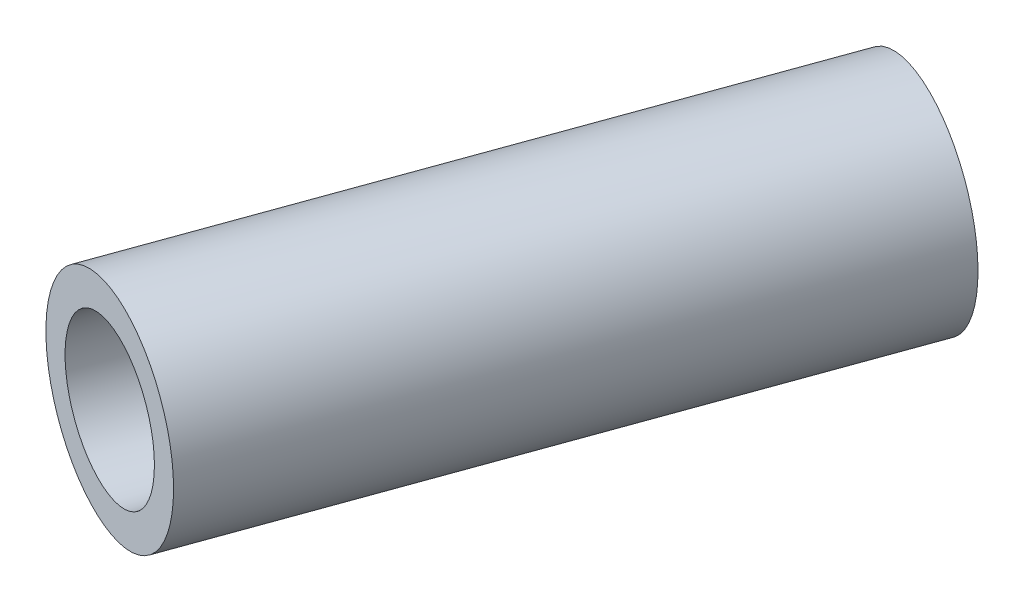
ISO-10303-21;
HEADER;
FILE_DESCRIPTION(('STEP AP214'),'2;1');
FILE_NAME('part.step','',(''),(''),'','','');
FILE_SCHEMA(('AUTOMOTIVE_DESIGN { 1 0 10303 214 1 1 1 1 }'));
ENDSEC;
DATA;
#1=APPLICATION_CONTEXT('core data for automotive mechanical design processes');
#2=APPLICATION_PROTOCOL_DEFINITION('international standard','automotive_design',2000,#1);
#3=PRODUCT_CONTEXT('',#1,'mechanical');
#4=PRODUCT('Part','Part','',(#3));
#5=PRODUCT_RELATED_PRODUCT_CATEGORY('part','',(#4));
#6=PRODUCT_DEFINITION_FORMATION('','',#4);
#7=PRODUCT_DEFINITION_CONTEXT('part definition',#1,'design');
#8=PRODUCT_DEFINITION('design','',#6,#7);
#9=PRODUCT_DEFINITION_SHAPE('','',#8);
#10=(LENGTH_UNIT() NAMED_UNIT(*) SI_UNIT(.MILLI.,.METRE.));
#11=(NAMED_UNIT(*) PLANE_ANGLE_UNIT() SI_UNIT($,.RADIAN.));
#12=(NAMED_UNIT(*) SI_UNIT($,.STERADIAN.) SOLID_ANGLE_UNIT());
#13=UNCERTAINTY_MEASURE_WITH_UNIT(LENGTH_MEASURE(1.E-05),#10,'distance_accuracy_value','');
#14=(GEOMETRIC_REPRESENTATION_CONTEXT(3) GLOBAL_UNCERTAINTY_ASSIGNED_CONTEXT((#13)) GLOBAL_UNIT_ASSIGNED_CONTEXT((#10,
#11,#12)) REPRESENTATION_CONTEXT('',''));
#15=CARTESIAN_POINT('',(0.,0.,0.));
#16=DIRECTION('',(0.,0.,1.));
#17=DIRECTION('',(1.,0.,0.));
#18=AXIS2_PLACEMENT_3D('',#15,#16,#17);
#19=CARTESIAN_POINT('',(246.406840064104,96.9201328703285,-211.742754731818));
#20=DIRECTION('',(-0.34065498940062,-0.000648415923502178,0.940188150187639));
#21=DIRECTION('',(0.940188347812545,1.0418301446532E-07,0.340655061077193));
#22=AXIS2_PLACEMENT_3D('',#19,#20,#21);
#23=PLANE('',#22);
#24=CARTESIAN_POINT('',(246.406840064104,96.9201328703285,-211.742754731818));
#25=DIRECTION('',(0.340654989400621,0.000648415923502179,-0.940188150187638));
#26=DIRECTION('',(0.940188347812545,1.04183015387876E-07,0.340655061077194));
#27=AXIS2_PLACEMENT_3D('',#24,#25,#26);
#28=CIRCLE('',#27,3.5);
#29=CARTESIAN_POINT('',(249.697499281447,96.920133234969,-210.550462018048));
#30=VERTEX_POINT('',#29);
#31=EDGE_CURVE('E11',#30,#30,#28,.T.);
#32=ORIENTED_EDGE('',*,*,#31,.T.);
#33=EDGE_LOOP('',(#32));
#34=FACE_BOUND('',#33,.T.);
#35=CARTESIAN_POINT('',(246.406840064104,96.9201328703285,-211.742754731818));
#36=DIRECTION('',(0.34065498940062,0.000648415923502178,-0.940188150187639));
#37=DIRECTION('',(0.940188347812545,1.04183014993986E-07,0.340655061077193));
#38=AXIS2_PLACEMENT_3D('',#35,#36,#37);
#39=CIRCLE('',#38,5.);
#40=CARTESIAN_POINT('',(251.107781803166,96.9201333912435,-210.039479426432));
#41=VERTEX_POINT('',#40);
#42=EDGE_CURVE('E43',#41,#41,#39,.T.);
#43=ORIENTED_EDGE('',*,*,#42,.F.);
#44=EDGE_LOOP('',(#43));
#45=FACE_BOUND('',#44,.T.);
#46=ADVANCED_FACE('F17',(#34,#45),#23,.T.);
#47=CARTESIAN_POINT('',(256.456162251422,96.9392611400718,-239.478305162353));
#48=DIRECTION('',(-0.34065498940062,-0.000648415923502178,0.940188150187639));
#49=DIRECTION('',(0.940188347812545,1.0418301446532E-07,0.340655061077193));
#50=AXIS2_PLACEMENT_3D('',#47,#48,#49);
#51=PLANE('',#50);
#52=CARTESIAN_POINT('',(256.456162251422,96.9392611400718,-239.478305162353));
#53=DIRECTION('',(0.340654989400621,0.000648415923502179,-0.940188150187638));
#54=DIRECTION('',(0.940188347812545,1.04183015387876E-07,0.340655061077194));
#55=AXIS2_PLACEMENT_3D('',#52,#53,#54);
#56=CIRCLE('',#55,3.5);
#57=CARTESIAN_POINT('',(259.746821468766,96.9392615047123,-238.286012448583));
#58=VERTEX_POINT('',#57);
#59=EDGE_CURVE('E38',#58,#58,#56,.T.);
#60=ORIENTED_EDGE('',*,*,#59,.F.);
#61=EDGE_LOOP('',(#60));
#62=FACE_BOUND('',#61,.T.);
#63=CARTESIAN_POINT('',(256.456162251422,96.9392611400718,-239.478305162353));
#64=DIRECTION('',(0.34065498940062,0.000648415923502178,-0.940188150187639));
#65=DIRECTION('',(0.940188347812545,1.04183014993986E-07,0.340655061077193));
#66=AXIS2_PLACEMENT_3D('',#63,#64,#65);
#67=CIRCLE('',#66,5.);
#68=CARTESIAN_POINT('',(261.157103990485,96.9392616609868,-237.775029856967));
#69=VERTEX_POINT('',#68);
#70=EDGE_CURVE('E21',#69,#69,#67,.T.);
#71=ORIENTED_EDGE('',*,*,#70,.T.);
#72=EDGE_LOOP('',(#71));
#73=FACE_BOUND('',#72,.T.);
#74=ADVANCED_FACE('F50',(#62,#73),#51,.F.);
#75=CARTESIAN_POINT('',(246.406840064104,96.9201328703285,-211.742754731818));
#76=DIRECTION('',(0.340654989400621,0.000648415923502179,-0.940188150187638));
#77=DIRECTION('',(-0.940188347812545,-1.04183015387853E-07,-0.340655061077194));
#78=AXIS2_PLACEMENT_3D('',#75,#76,#77);
#79=CYLINDRICAL_SURFACE('',#78,3.5);
#80=ORIENTED_EDGE('',*,*,#31,.F.);
#81=EDGE_LOOP('',(#80));
#82=FACE_BOUND('',#81,.T.);
#83=ORIENTED_EDGE('',*,*,#59,.T.);
#84=EDGE_LOOP('',(#83));
#85=FACE_BOUND('',#84,.T.);
#86=ADVANCED_FACE('F57',(#82,#85),#79,.F.);
#87=CARTESIAN_POINT('',(246.406840064104,96.9201328703285,-211.742754731818));
#88=DIRECTION('',(0.340654989400621,0.000648415923502179,-0.940188150187638));
#89=DIRECTION('',(-0.940188347812545,-1.0418301499336E-07,-0.340655061077194));
#90=AXIS2_PLACEMENT_3D('',#87,#88,#89);
#91=CYLINDRICAL_SURFACE('',#90,5.);
#92=ORIENTED_EDGE('',*,*,#42,.T.);
#93=EDGE_LOOP('',(#92));
#94=FACE_BOUND('',#93,.T.);
#95=ORIENTED_EDGE('',*,*,#70,.F.);
#96=EDGE_LOOP('',(#95));
#97=FACE_BOUND('',#96,.T.);
#98=ADVANCED_FACE('F19',(#94,#97),#91,.T.);
#99=CLOSED_SHELL('',(#46,#74,#86,#98));
#100=MANIFOLD_SOLID_BREP('B1',#99);
#101=ADVANCED_BREP_SHAPE_REPRESENTATION('',(#18,#100),#14);
#102=SHAPE_DEFINITION_REPRESENTATION(#9,#101);
ENDSEC;
END-ISO-10303-21;
